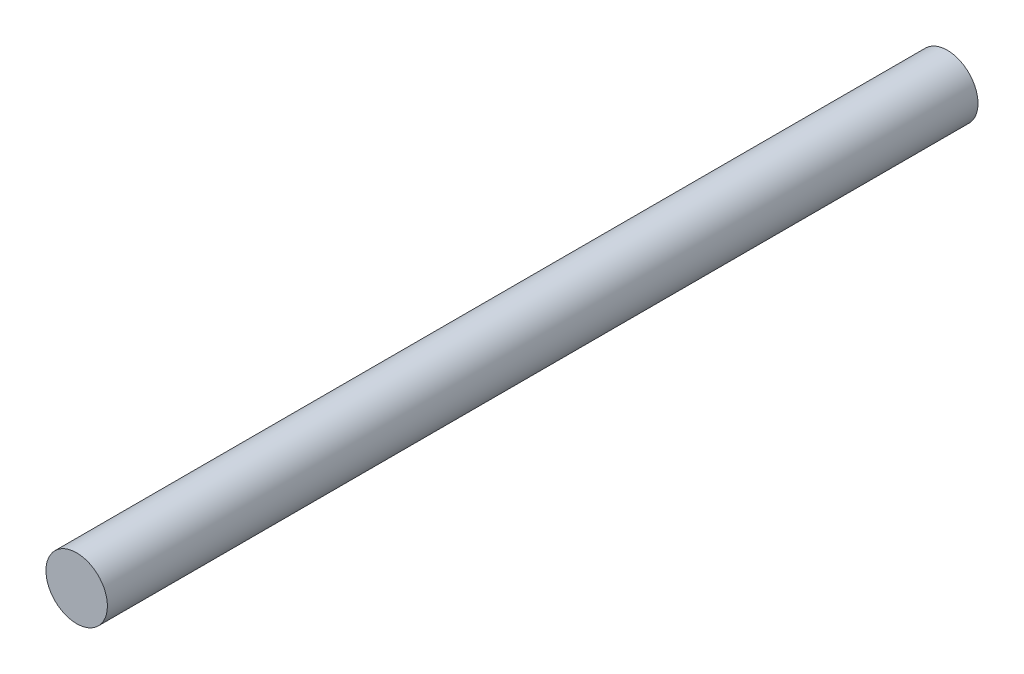
ISO-10303-21;
HEADER;
FILE_DESCRIPTION(('STEP AP214'),'2;1');
FILE_NAME('part.step','',(''),(''),'','','');
FILE_SCHEMA(('AUTOMOTIVE_DESIGN { 1 0 10303 214 1 1 1 1 }'));
ENDSEC;
DATA;
#1=APPLICATION_CONTEXT('core data for automotive mechanical design processes');
#2=APPLICATION_PROTOCOL_DEFINITION('international standard','automotive_design',2000,#1);
#3=PRODUCT_CONTEXT('',#1,'mechanical');
#4=PRODUCT('Part','Part','',(#3));
#5=PRODUCT_RELATED_PRODUCT_CATEGORY('part','',(#4));
#6=PRODUCT_DEFINITION_FORMATION('','',#4);
#7=PRODUCT_DEFINITION_CONTEXT('part definition',#1,'design');
#8=PRODUCT_DEFINITION('design','',#6,#7);
#9=PRODUCT_DEFINITION_SHAPE('','',#8);
#10=(LENGTH_UNIT() NAMED_UNIT(*) SI_UNIT(.MILLI.,.METRE.));
#11=(NAMED_UNIT(*) PLANE_ANGLE_UNIT() SI_UNIT($,.RADIAN.));
#12=(NAMED_UNIT(*) SI_UNIT($,.STERADIAN.) SOLID_ANGLE_UNIT());
#13=UNCERTAINTY_MEASURE_WITH_UNIT(LENGTH_MEASURE(1.E-05),#10,'distance_accuracy_value','');
#14=(GEOMETRIC_REPRESENTATION_CONTEXT(3) GLOBAL_UNCERTAINTY_ASSIGNED_CONTEXT((#13)) GLOBAL_UNIT_ASSIGNED_CONTEXT((#10,
#11,#12)) REPRESENTATION_CONTEXT('',''));
#15=CARTESIAN_POINT('',(0.,0.,0.));
#16=DIRECTION('',(0.,0.,1.));
#17=DIRECTION('',(1.,0.,0.));
#18=AXIS2_PLACEMENT_3D('',#15,#16,#17);
#19=CARTESIAN_POINT('',(0.,0.,85.));
#20=DIRECTION('',(0.,0.,-1.));
#21=DIRECTION('',(-1.,0.,0.));
#22=AXIS2_PLACEMENT_3D('',#19,#20,#21);
#23=CYLINDRICAL_SURFACE('',#22,6.);
#24=CARTESIAN_POINT('',(0.,0.,85.));
#25=DIRECTION('',(0.,0.,1.));
#26=DIRECTION('',(1.,0.,0.));
#27=AXIS2_PLACEMENT_3D('',#24,#25,#26);
#28=CIRCLE('',#27,6.);
#29=CARTESIAN_POINT('',(6.,0.,85.));
#30=VERTEX_POINT('',#29);
#31=EDGE_CURVE('E10',#30,#30,#28,.T.);
#32=ORIENTED_EDGE('',*,*,#31,.F.);
#33=EDGE_LOOP('',(#32));
#34=FACE_BOUND('',#33,.T.);
#35=CARTESIAN_POINT('',(0.,0.,-85.));
#36=DIRECTION('',(0.,0.,1.));
#37=DIRECTION('',(1.,0.,0.));
#38=AXIS2_PLACEMENT_3D('',#35,#36,#37);
#39=CIRCLE('',#38,6.);
#40=CARTESIAN_POINT('',(6.,0.,-85.));
#41=VERTEX_POINT('',#40);
#42=EDGE_CURVE('E33',#41,#41,#39,.T.);
#43=ORIENTED_EDGE('',*,*,#42,.T.);
#44=EDGE_LOOP('',(#43));
#45=FACE_BOUND('',#44,.T.);
#46=ADVANCED_FACE('F30',(#34,#45),#23,.T.);
#47=CARTESIAN_POINT('',(0.,0.,85.));
#48=DIRECTION('',(0.,0.,1.));
#49=DIRECTION('',(1.,0.,0.));
#50=AXIS2_PLACEMENT_3D('',#47,#48,#49);
#51=PLANE('',#50);
#52=ORIENTED_EDGE('',*,*,#31,.T.);
#53=EDGE_LOOP('',(#52));
#54=FACE_BOUND('',#53,.T.);
#55=ADVANCED_FACE('F45',(#54),#51,.T.);
#56=CARTESIAN_POINT('',(0.,0.,-85.));
#57=DIRECTION('',(0.,0.,1.));
#58=DIRECTION('',(1.,0.,0.));
#59=AXIS2_PLACEMENT_3D('',#56,#57,#58);
#60=PLANE('',#59);
#61=ORIENTED_EDGE('',*,*,#42,.F.);
#62=EDGE_LOOP('',(#61));
#63=FACE_BOUND('',#62,.T.);
#64=ADVANCED_FACE('F43',(#63),#60,.F.);
#65=CLOSED_SHELL('',(#46,#55,#64));
#66=MANIFOLD_SOLID_BREP('B2',#65);
#67=ADVANCED_BREP_SHAPE_REPRESENTATION('',(#18,#66),#14);
#68=SHAPE_DEFINITION_REPRESENTATION(#9,#67);
ENDSEC;
END-ISO-10303-21;
